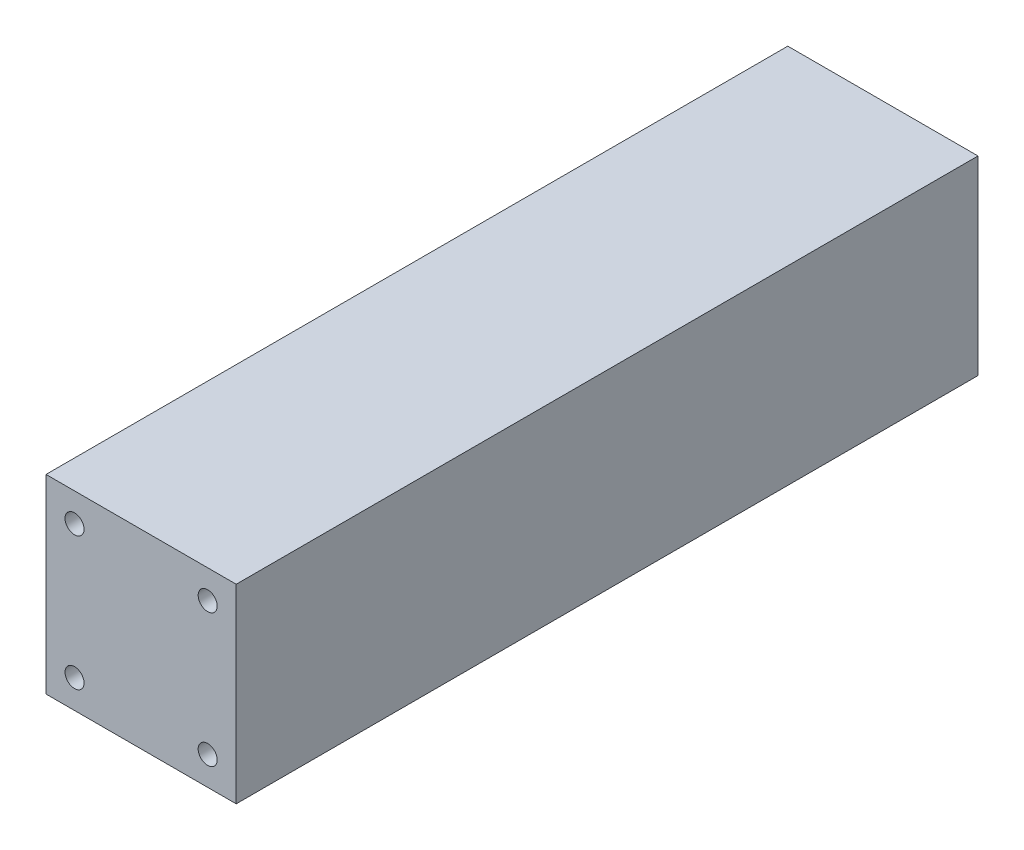
ISO-10303-21;
HEADER;
FILE_DESCRIPTION(('STEP AP214'),'2;1');
FILE_NAME('part.step','',(''),(''),'','','');
FILE_SCHEMA(('AUTOMOTIVE_DESIGN { 1 0 10303 214 1 1 1 1 }'));
ENDSEC;
DATA;
#1=APPLICATION_CONTEXT('core data for automotive mechanical design processes');
#2=APPLICATION_PROTOCOL_DEFINITION('international standard','automotive_design',2000,#1);
#3=PRODUCT_CONTEXT('',#1,'mechanical');
#4=PRODUCT('Part','Part','',(#3));
#5=PRODUCT_RELATED_PRODUCT_CATEGORY('part','',(#4));
#6=PRODUCT_DEFINITION_FORMATION('','',#4);
#7=PRODUCT_DEFINITION_CONTEXT('part definition',#1,'design');
#8=PRODUCT_DEFINITION('design','',#6,#7);
#9=PRODUCT_DEFINITION_SHAPE('','',#8);
#10=(LENGTH_UNIT() NAMED_UNIT(*) SI_UNIT(.MILLI.,.METRE.));
#11=(NAMED_UNIT(*) PLANE_ANGLE_UNIT() SI_UNIT($,.RADIAN.));
#12=(NAMED_UNIT(*) SI_UNIT($,.STERADIAN.) SOLID_ANGLE_UNIT());
#13=UNCERTAINTY_MEASURE_WITH_UNIT(LENGTH_MEASURE(1.E-05),#10,'distance_accuracy_value','');
#14=(GEOMETRIC_REPRESENTATION_CONTEXT(3) GLOBAL_UNCERTAINTY_ASSIGNED_CONTEXT((#13)) GLOBAL_UNIT_ASSIGNED_CONTEXT((#10,
#11,#12)) REPRESENTATION_CONTEXT('',''));
#15=CARTESIAN_POINT('',(0.,0.,0.));
#16=DIRECTION('',(0.,0.,1.));
#17=DIRECTION('',(1.,0.,0.));
#18=AXIS2_PLACEMENT_3D('',#15,#16,#17);
#19=CARTESIAN_POINT('',(-63.5,63.5,495.3));
#20=DIRECTION('',(1.,0.,0.));
#21=DIRECTION('',(0.,1.,0.));
#22=AXIS2_PLACEMENT_3D('',#19,#20,#21);
#23=PLANE('',#22);
#24=DIRECTION('',(0.,-1.,0.));
#25=VECTOR('',#24,1.);
#26=CARTESIAN_POINT('',(-63.5,63.5,0.));
#27=LINE('',#26,#25);
#28=CARTESIAN_POINT('',(-63.5,63.5,0.));
#29=VERTEX_POINT('',#28);
#30=CARTESIAN_POINT('',(-63.5,-63.5,0.));
#31=VERTEX_POINT('',#30);
#32=EDGE_CURVE('E211',#29,#31,#27,.T.);
#33=ORIENTED_EDGE('',*,*,#32,.T.);
#34=DIRECTION('',(0.,0.,-1.));
#35=VECTOR('',#34,1.);
#36=CARTESIAN_POINT('',(-63.5,-63.5,495.3));
#37=LINE('',#36,#35);
#38=CARTESIAN_POINT('',(-63.5,-63.5,495.3));
#39=VERTEX_POINT('',#38);
#40=EDGE_CURVE('E11',#39,#31,#37,.T.);
#41=ORIENTED_EDGE('',*,*,#40,.F.);
#42=DIRECTION('',(0.,-1.,0.));
#43=VECTOR('',#42,1.);
#44=CARTESIAN_POINT('',(-63.5,63.5,495.3));
#45=LINE('',#44,#43);
#46=CARTESIAN_POINT('',(-63.5,63.5,495.3));
#47=VERTEX_POINT('',#46);
#48=EDGE_CURVE('E212',#47,#39,#45,.T.);
#49=ORIENTED_EDGE('',*,*,#48,.F.);
#50=DIRECTION('',(0.,0.,-1.));
#51=VECTOR('',#50,1.);
#52=CARTESIAN_POINT('',(-63.5,63.5,495.3));
#53=LINE('',#52,#51);
#54=EDGE_CURVE('E218',#47,#29,#53,.T.);
#55=ORIENTED_EDGE('',*,*,#54,.T.);
#56=EDGE_LOOP('',(#33,#41,#49,#55));
#57=FACE_BOUND('',#56,.T.);
#58=ADVANCED_FACE('F38',(#57),#23,.F.);
#59=CARTESIAN_POINT('',(-63.5,-63.5,495.3));
#60=DIRECTION('',(0.,1.,0.));
#61=DIRECTION('',(-1.,0.,0.));
#62=AXIS2_PLACEMENT_3D('',#59,#60,#61);
#63=PLANE('',#62);
#64=DIRECTION('',(1.,0.,0.));
#65=VECTOR('',#64,1.);
#66=CARTESIAN_POINT('',(-63.5,-63.5,0.));
#67=LINE('',#66,#65);
#68=CARTESIAN_POINT('',(63.5,-63.5,0.));
#69=VERTEX_POINT('',#68);
#70=EDGE_CURVE('E221',#31,#69,#67,.T.);
#71=ORIENTED_EDGE('',*,*,#70,.T.);
#72=DIRECTION('',(0.,0.,-1.));
#73=VECTOR('',#72,1.);
#74=CARTESIAN_POINT('',(63.5,-63.5,495.3));
#75=LINE('',#74,#73);
#76=CARTESIAN_POINT('',(63.5,-63.5,495.3));
#77=VERTEX_POINT('',#76);
#78=EDGE_CURVE('E46',#77,#69,#75,.T.);
#79=ORIENTED_EDGE('',*,*,#78,.F.);
#80=DIRECTION('',(1.,0.,0.));
#81=VECTOR('',#80,1.);
#82=CARTESIAN_POINT('',(-63.5,-63.5,495.3));
#83=LINE('',#82,#81);
#84=EDGE_CURVE('E85',#39,#77,#83,.T.);
#85=ORIENTED_EDGE('',*,*,#84,.F.);
#86=ORIENTED_EDGE('',*,*,#40,.T.);
#87=EDGE_LOOP('',(#71,#79,#85,#86));
#88=FACE_BOUND('',#87,.T.);
#89=ADVANCED_FACE('F245',(#88),#63,.F.);
#90=CARTESIAN_POINT('',(63.5,63.5,495.3));
#91=DIRECTION('',(-1.,0.,0.));
#92=DIRECTION('',(0.,-1.,0.));
#93=AXIS2_PLACEMENT_3D('',#90,#91,#92);
#94=PLANE('',#93);
#95=DIRECTION('',(0.,1.,0.));
#96=VECTOR('',#95,1.);
#97=CARTESIAN_POINT('',(63.5,63.5,0.));
#98=LINE('',#97,#96);
#99=CARTESIAN_POINT('',(63.5,63.5,0.));
#100=VERTEX_POINT('',#99);
#101=EDGE_CURVE('E72',#69,#100,#98,.T.);
#102=ORIENTED_EDGE('',*,*,#101,.T.);
#103=DIRECTION('',(0.,0.,-1.));
#104=VECTOR('',#103,1.);
#105=CARTESIAN_POINT('',(63.5,63.5,495.3));
#106=LINE('',#105,#104);
#107=CARTESIAN_POINT('',(63.5,63.5,495.3));
#108=VERTEX_POINT('',#107);
#109=EDGE_CURVE('E226',#108,#100,#106,.T.);
#110=ORIENTED_EDGE('',*,*,#109,.F.);
#111=DIRECTION('',(0.,1.,0.));
#112=VECTOR('',#111,1.);
#113=CARTESIAN_POINT('',(63.5,63.5,495.3));
#114=LINE('',#113,#112);
#115=EDGE_CURVE('E215',#77,#108,#114,.T.);
#116=ORIENTED_EDGE('',*,*,#115,.F.);
#117=ORIENTED_EDGE('',*,*,#78,.T.);
#118=EDGE_LOOP('',(#102,#110,#116,#117));
#119=FACE_BOUND('',#118,.T.);
#120=ADVANCED_FACE('F228',(#119),#94,.F.);
#121=CARTESIAN_POINT('',(-63.5,63.5,495.3));
#122=DIRECTION('',(0.,-1.,0.));
#123=DIRECTION('',(0.,0.,-1.));
#124=AXIS2_PLACEMENT_3D('',#121,#122,#123);
#125=PLANE('',#124);
#126=DIRECTION('',(-1.,0.,0.));
#127=VECTOR('',#126,1.);
#128=CARTESIAN_POINT('',(-63.5,63.5,0.));
#129=LINE('',#128,#127);
#130=EDGE_CURVE('E78',#100,#29,#129,.T.);
#131=ORIENTED_EDGE('',*,*,#130,.T.);
#132=ORIENTED_EDGE('',*,*,#54,.F.);
#133=DIRECTION('',(-1.,0.,0.));
#134=VECTOR('',#133,1.);
#135=CARTESIAN_POINT('',(-63.5,63.5,495.3));
#136=LINE('',#135,#134);
#137=EDGE_CURVE('E54',#108,#47,#136,.T.);
#138=ORIENTED_EDGE('',*,*,#137,.F.);
#139=ORIENTED_EDGE('',*,*,#109,.T.);
#140=EDGE_LOOP('',(#131,#132,#138,#139));
#141=FACE_BOUND('',#140,.T.);
#142=ADVANCED_FACE('F235',(#141),#125,.F.);
#143=CARTESIAN_POINT('',(-63.5,-63.5,495.3));
#144=DIRECTION('',(0.,0.,1.));
#145=DIRECTION('',(1.,0.,0.));
#146=AXIS2_PLACEMENT_3D('',#143,#144,#145);
#147=PLANE('',#146);
#148=CARTESIAN_POINT('',(44.45,44.45,495.3));
#149=DIRECTION('',(0.,0.,1.));
#150=DIRECTION('',(1.,0.,0.));
#151=AXIS2_PLACEMENT_3D('',#148,#149,#150);
#152=CIRCLE('',#151,6.34999999999999);
#153=CARTESIAN_POINT('',(50.8,44.45,495.3));
#154=VERTEX_POINT('',#153);
#155=EDGE_CURVE('E163',#154,#154,#152,.T.);
#156=ORIENTED_EDGE('',*,*,#155,.F.);
#157=EDGE_LOOP('',(#156));
#158=FACE_BOUND('',#157,.T.);
#159=CARTESIAN_POINT('',(44.45,-44.45,495.3));
#160=DIRECTION('',(0.,0.,1.));
#161=DIRECTION('',(1.,0.,0.));
#162=AXIS2_PLACEMENT_3D('',#159,#160,#161);
#163=CIRCLE('',#162,6.34999999999999);
#164=CARTESIAN_POINT('',(50.8,-44.45,495.3));
#165=VERTEX_POINT('',#164);
#166=EDGE_CURVE('E175',#165,#165,#163,.T.);
#167=ORIENTED_EDGE('',*,*,#166,.F.);
#168=EDGE_LOOP('',(#167));
#169=FACE_BOUND('',#168,.T.);
#170=CARTESIAN_POINT('',(-44.45,-44.45,495.3));
#171=DIRECTION('',(0.,0.,1.));
#172=DIRECTION('',(1.,0.,0.));
#173=AXIS2_PLACEMENT_3D('',#170,#171,#172);
#174=CIRCLE('',#173,6.34999999999999);
#175=CARTESIAN_POINT('',(-38.1,-44.45,495.3));
#176=VERTEX_POINT('',#175);
#177=EDGE_CURVE('E187',#176,#176,#174,.T.);
#178=ORIENTED_EDGE('',*,*,#177,.F.);
#179=EDGE_LOOP('',(#178));
#180=FACE_BOUND('',#179,.T.);
#181=CARTESIAN_POINT('',(-44.45,44.45,495.3));
#182=DIRECTION('',(0.,0.,1.));
#183=DIRECTION('',(1.,0.,0.));
#184=AXIS2_PLACEMENT_3D('',#181,#182,#183);
#185=CIRCLE('',#184,6.34999999999999);
#186=CARTESIAN_POINT('',(-38.1,44.45,495.3));
#187=VERTEX_POINT('',#186);
#188=EDGE_CURVE('E199',#187,#187,#185,.T.);
#189=ORIENTED_EDGE('',*,*,#188,.F.);
#190=EDGE_LOOP('',(#189));
#191=FACE_BOUND('',#190,.T.);
#192=ORIENTED_EDGE('',*,*,#48,.T.);
#193=ORIENTED_EDGE('',*,*,#84,.T.);
#194=ORIENTED_EDGE('',*,*,#115,.T.);
#195=ORIENTED_EDGE('',*,*,#137,.T.);
#196=EDGE_LOOP('',(#192,#193,#194,#195));
#197=FACE_BOUND('',#196,.T.);
#198=ADVANCED_FACE('F237',(#158,#169,#180,#191,#197),#147,.T.);
#199=CARTESIAN_POINT('',(-63.5,-63.5,0.));
#200=DIRECTION('',(0.,0.,1.));
#201=DIRECTION('',(1.,0.,0.));
#202=AXIS2_PLACEMENT_3D('',#199,#200,#201);
#203=PLANE('',#202);
#204=CARTESIAN_POINT('',(44.45,44.45,0.));
#205=DIRECTION('',(0.,0.,-1.));
#206=DIRECTION('',(-1.,0.,0.));
#207=AXIS2_PLACEMENT_3D('',#204,#205,#206);
#208=CIRCLE('',#207,6.34999999999999);
#209=CARTESIAN_POINT('',(38.1,44.45,0.));
#210=VERTEX_POINT('',#209);
#211=EDGE_CURVE('E600',#210,#210,#208,.T.);
#212=ORIENTED_EDGE('',*,*,#211,.F.);
#213=EDGE_LOOP('',(#212));
#214=FACE_BOUND('',#213,.T.);
#215=CARTESIAN_POINT('',(-44.45,44.45,0.));
#216=DIRECTION('',(0.,0.,-1.));
#217=DIRECTION('',(-1.,0.,0.));
#218=AXIS2_PLACEMENT_3D('',#215,#216,#217);
#219=CIRCLE('',#218,6.34999999999999);
#220=CARTESIAN_POINT('',(-50.8,44.45,0.));
#221=VERTEX_POINT('',#220);
#222=EDGE_CURVE('E120',#221,#221,#219,.T.);
#223=ORIENTED_EDGE('',*,*,#222,.F.);
#224=EDGE_LOOP('',(#223));
#225=FACE_BOUND('',#224,.T.);
#226=CARTESIAN_POINT('',(44.45,-44.45,0.));
#227=DIRECTION('',(0.,0.,-1.));
#228=DIRECTION('',(-1.,0.,0.));
#229=AXIS2_PLACEMENT_3D('',#226,#227,#228);
#230=CIRCLE('',#229,6.34999999999999);
#231=CARTESIAN_POINT('',(38.1,-44.45,0.));
#232=VERTEX_POINT('',#231);
#233=EDGE_CURVE('E139',#232,#232,#230,.T.);
#234=ORIENTED_EDGE('',*,*,#233,.F.);
#235=EDGE_LOOP('',(#234));
#236=FACE_BOUND('',#235,.T.);
#237=CARTESIAN_POINT('',(-44.45,-44.45,0.));
#238=DIRECTION('',(0.,0.,-1.));
#239=DIRECTION('',(-1.,0.,0.));
#240=AXIS2_PLACEMENT_3D('',#237,#238,#239);
#241=CIRCLE('',#240,6.34999999999999);
#242=CARTESIAN_POINT('',(-50.8,-44.45,0.));
#243=VERTEX_POINT('',#242);
#244=EDGE_CURVE('E151',#243,#243,#241,.T.);
#245=ORIENTED_EDGE('',*,*,#244,.F.);
#246=EDGE_LOOP('',(#245));
#247=FACE_BOUND('',#246,.T.);
#248=ORIENTED_EDGE('',*,*,#32,.F.);
#249=ORIENTED_EDGE('',*,*,#130,.F.);
#250=ORIENTED_EDGE('',*,*,#101,.F.);
#251=ORIENTED_EDGE('',*,*,#70,.F.);
#252=EDGE_LOOP('',(#248,#249,#250,#251));
#253=FACE_BOUND('',#252,.T.);
#254=ADVANCED_FACE('F231',(#214,#225,#236,#247,#253),#203,.F.);
#255=CARTESIAN_POINT('',(-44.45,44.45,464.0326));
#256=DIRECTION('',(0.,0.,1.));
#257=DIRECTION('',(1.,0.,0.));
#258=AXIS2_PLACEMENT_3D('',#255,#256,#257);
#259=CONICAL_SURFACE('',#258,5.35813,1.02974425867665);
#260=CARTESIAN_POINT('',(-44.45,44.45,460.81311069137));
#261=VERTEX_POINT('',#260);
#262=VERTEX_LOOP('',#261);
#263=FACE_BOUND('',#262,.T.);
#264=CARTESIAN_POINT('',(-44.45,44.45,464.0326));
#265=DIRECTION('',(0.,0.,1.));
#266=DIRECTION('',(1.,0.,0.));
#267=AXIS2_PLACEMENT_3D('',#264,#265,#266);
#268=CIRCLE('',#267,5.35813);
#269=CARTESIAN_POINT('',(-39.09187,44.45,464.0326));
#270=VERTEX_POINT('',#269);
#271=EDGE_CURVE('E208',#270,#270,#268,.T.);
#272=ORIENTED_EDGE('',*,*,#271,.T.);
#273=EDGE_LOOP('',(#272));
#274=FACE_BOUND('',#273,.T.);
#275=ADVANCED_FACE('F279',(#263,#274),#259,.F.);
#276=CARTESIAN_POINT('',(-44.45,44.45,495.3));
#277=DIRECTION('',(0.,0.,1.));
#278=DIRECTION('',(1.,0.,0.));
#279=AXIS2_PLACEMENT_3D('',#276,#277,#278);
#280=CYLINDRICAL_SURFACE('',#279,5.35813);
#281=ORIENTED_EDGE('',*,*,#271,.F.);
#282=EDGE_LOOP('',(#281));
#283=FACE_BOUND('',#282,.T.);
#284=CARTESIAN_POINT('',(-44.45,44.45,469.9));
#285=DIRECTION('',(0.,0.,1.));
#286=DIRECTION('',(1.,0.,0.));
#287=AXIS2_PLACEMENT_3D('',#284,#285,#286);
#288=CIRCLE('',#287,5.35813);
#289=CARTESIAN_POINT('',(-39.09187,44.45,469.9));
#290=VERTEX_POINT('',#289);
#291=EDGE_CURVE('E205',#290,#290,#288,.T.);
#292=ORIENTED_EDGE('',*,*,#291,.T.);
#293=EDGE_LOOP('',(#292));
#294=FACE_BOUND('',#293,.T.);
#295=ADVANCED_FACE('F288',(#283,#294),#280,.F.);
#296=CARTESIAN_POINT('',(-39.09187,44.45,469.9));
#297=DIRECTION('',(0.,0.,-1.));
#298=DIRECTION('',(-1.,0.,0.));
#299=AXIS2_PLACEMENT_3D('',#296,#297,#298);
#300=PLANE('',#299);
#301=ORIENTED_EDGE('',*,*,#291,.F.);
#302=EDGE_LOOP('',(#301));
#303=FACE_BOUND('',#302,.T.);
#304=CARTESIAN_POINT('',(-44.45,44.45,469.9));
#305=DIRECTION('',(0.,0.,1.));
#306=DIRECTION('',(1.,0.,0.));
#307=AXIS2_PLACEMENT_3D('',#304,#305,#306);
#308=CIRCLE('',#307,6.34999999999999);
#309=CARTESIAN_POINT('',(-38.1,44.45,469.9));
#310=VERTEX_POINT('',#309);
#311=EDGE_CURVE('E202',#310,#310,#308,.T.);
#312=ORIENTED_EDGE('',*,*,#311,.T.);
#313=EDGE_LOOP('',(#312));
#314=FACE_BOUND('',#313,.T.);
#315=ADVANCED_FACE('F298',(#303,#314),#300,.F.);
#316=CARTESIAN_POINT('',(-44.45,44.45,495.3));
#317=DIRECTION('',(0.,0.,1.));
#318=DIRECTION('',(1.,0.,0.));
#319=AXIS2_PLACEMENT_3D('',#316,#317,#318);
#320=CYLINDRICAL_SURFACE('',#319,6.34999999999999);
#321=ORIENTED_EDGE('',*,*,#311,.F.);
#322=EDGE_LOOP('',(#321));
#323=FACE_BOUND('',#322,.T.);
#324=ORIENTED_EDGE('',*,*,#188,.T.);
#325=EDGE_LOOP('',(#324));
#326=FACE_BOUND('',#325,.T.);
#327=ADVANCED_FACE('F308',(#323,#326),#320,.F.);
#328=CARTESIAN_POINT('',(-44.45,-44.45,464.0326));
#329=DIRECTION('',(0.,0.,1.));
#330=DIRECTION('',(1.,0.,0.));
#331=AXIS2_PLACEMENT_3D('',#328,#329,#330);
#332=CONICAL_SURFACE('',#331,5.35813,1.02974425867665);
#333=CARTESIAN_POINT('',(-44.45,-44.45,460.81311069137));
#334=VERTEX_POINT('',#333);
#335=VERTEX_LOOP('',#334);
#336=FACE_BOUND('',#335,.T.);
#337=CARTESIAN_POINT('',(-44.45,-44.45,464.0326));
#338=DIRECTION('',(0.,0.,1.));
#339=DIRECTION('',(1.,0.,0.));
#340=AXIS2_PLACEMENT_3D('',#337,#338,#339);
#341=CIRCLE('',#340,5.35813);
#342=CARTESIAN_POINT('',(-39.09187,-44.45,464.0326));
#343=VERTEX_POINT('',#342);
#344=EDGE_CURVE('E196',#343,#343,#341,.T.);
#345=ORIENTED_EDGE('',*,*,#344,.T.);
#346=EDGE_LOOP('',(#345));
#347=FACE_BOUND('',#346,.T.);
#348=ADVANCED_FACE('F318',(#336,#347),#332,.F.);
#349=CARTESIAN_POINT('',(-44.45,-44.45,495.3));
#350=DIRECTION('',(0.,0.,1.));
#351=DIRECTION('',(1.,0.,0.));
#352=AXIS2_PLACEMENT_3D('',#349,#350,#351);
#353=CYLINDRICAL_SURFACE('',#352,5.35813);
#354=ORIENTED_EDGE('',*,*,#344,.F.);
#355=EDGE_LOOP('',(#354));
#356=FACE_BOUND('',#355,.T.);
#357=CARTESIAN_POINT('',(-44.45,-44.45,469.9));
#358=DIRECTION('',(0.,0.,1.));
#359=DIRECTION('',(1.,0.,0.));
#360=AXIS2_PLACEMENT_3D('',#357,#358,#359);
#361=CIRCLE('',#360,5.35813);
#362=CARTESIAN_POINT('',(-39.09187,-44.45,469.9));
#363=VERTEX_POINT('',#362);
#364=EDGE_CURVE('E193',#363,#363,#361,.T.);
#365=ORIENTED_EDGE('',*,*,#364,.T.);
#366=EDGE_LOOP('',(#365));
#367=FACE_BOUND('',#366,.T.);
#368=ADVANCED_FACE('F328',(#356,#367),#353,.F.);
#369=CARTESIAN_POINT('',(-39.09187,-44.45,469.9));
#370=DIRECTION('',(0.,0.,-1.));
#371=DIRECTION('',(-1.,0.,0.));
#372=AXIS2_PLACEMENT_3D('',#369,#370,#371);
#373=PLANE('',#372);
#374=ORIENTED_EDGE('',*,*,#364,.F.);
#375=EDGE_LOOP('',(#374));
#376=FACE_BOUND('',#375,.T.);
#377=CARTESIAN_POINT('',(-44.45,-44.45,469.9));
#378=DIRECTION('',(0.,0.,1.));
#379=DIRECTION('',(1.,0.,0.));
#380=AXIS2_PLACEMENT_3D('',#377,#378,#379);
#381=CIRCLE('',#380,6.34999999999999);
#382=CARTESIAN_POINT('',(-38.1,-44.45,469.9));
#383=VERTEX_POINT('',#382);
#384=EDGE_CURVE('E190',#383,#383,#381,.T.);
#385=ORIENTED_EDGE('',*,*,#384,.T.);
#386=EDGE_LOOP('',(#385));
#387=FACE_BOUND('',#386,.T.);
#388=ADVANCED_FACE('F338',(#376,#387),#373,.F.);
#389=CARTESIAN_POINT('',(-44.45,-44.45,495.3));
#390=DIRECTION('',(0.,0.,1.));
#391=DIRECTION('',(1.,0.,0.));
#392=AXIS2_PLACEMENT_3D('',#389,#390,#391);
#393=CYLINDRICAL_SURFACE('',#392,6.34999999999999);
#394=ORIENTED_EDGE('',*,*,#384,.F.);
#395=EDGE_LOOP('',(#394));
#396=FACE_BOUND('',#395,.T.);
#397=ORIENTED_EDGE('',*,*,#177,.T.);
#398=EDGE_LOOP('',(#397));
#399=FACE_BOUND('',#398,.T.);
#400=ADVANCED_FACE('F348',(#396,#399),#393,.F.);
#401=CARTESIAN_POINT('',(44.45,-44.45,464.0326));
#402=DIRECTION('',(0.,0.,1.));
#403=DIRECTION('',(1.,0.,0.));
#404=AXIS2_PLACEMENT_3D('',#401,#402,#403);
#405=CONICAL_SURFACE('',#404,5.35813,1.02974425867665);
#406=CARTESIAN_POINT('',(44.45,-44.45,460.81311069137));
#407=VERTEX_POINT('',#406);
#408=VERTEX_LOOP('',#407);
#409=FACE_BOUND('',#408,.T.);
#410=CARTESIAN_POINT('',(44.45,-44.45,464.0326));
#411=DIRECTION('',(0.,0.,1.));
#412=DIRECTION('',(1.,0.,0.));
#413=AXIS2_PLACEMENT_3D('',#410,#411,#412);
#414=CIRCLE('',#413,5.35813);
#415=CARTESIAN_POINT('',(49.80813,-44.45,464.0326));
#416=VERTEX_POINT('',#415);
#417=EDGE_CURVE('E184',#416,#416,#414,.T.);
#418=ORIENTED_EDGE('',*,*,#417,.T.);
#419=EDGE_LOOP('',(#418));
#420=FACE_BOUND('',#419,.T.);
#421=ADVANCED_FACE('F358',(#409,#420),#405,.F.);
#422=CARTESIAN_POINT('',(44.45,-44.45,495.3));
#423=DIRECTION('',(0.,0.,1.));
#424=DIRECTION('',(1.,0.,0.));
#425=AXIS2_PLACEMENT_3D('',#422,#423,#424);
#426=CYLINDRICAL_SURFACE('',#425,5.35813);
#427=ORIENTED_EDGE('',*,*,#417,.F.);
#428=EDGE_LOOP('',(#427));
#429=FACE_BOUND('',#428,.T.);
#430=CARTESIAN_POINT('',(44.45,-44.45,469.9));
#431=DIRECTION('',(0.,0.,1.));
#432=DIRECTION('',(1.,0.,0.));
#433=AXIS2_PLACEMENT_3D('',#430,#431,#432);
#434=CIRCLE('',#433,5.35813);
#435=CARTESIAN_POINT('',(49.80813,-44.45,469.9));
#436=VERTEX_POINT('',#435);
#437=EDGE_CURVE('E181',#436,#436,#434,.T.);
#438=ORIENTED_EDGE('',*,*,#437,.T.);
#439=EDGE_LOOP('',(#438));
#440=FACE_BOUND('',#439,.T.);
#441=ADVANCED_FACE('F368',(#429,#440),#426,.F.);
#442=CARTESIAN_POINT('',(49.80813,-44.45,469.9));
#443=DIRECTION('',(0.,0.,-1.));
#444=DIRECTION('',(-1.,0.,0.));
#445=AXIS2_PLACEMENT_3D('',#442,#443,#444);
#446=PLANE('',#445);
#447=ORIENTED_EDGE('',*,*,#437,.F.);
#448=EDGE_LOOP('',(#447));
#449=FACE_BOUND('',#448,.T.);
#450=CARTESIAN_POINT('',(44.45,-44.45,469.9));
#451=DIRECTION('',(0.,0.,1.));
#452=DIRECTION('',(1.,0.,0.));
#453=AXIS2_PLACEMENT_3D('',#450,#451,#452);
#454=CIRCLE('',#453,6.34999999999999);
#455=CARTESIAN_POINT('',(50.8,-44.45,469.9));
#456=VERTEX_POINT('',#455);
#457=EDGE_CURVE('E178',#456,#456,#454,.T.);
#458=ORIENTED_EDGE('',*,*,#457,.T.);
#459=EDGE_LOOP('',(#458));
#460=FACE_BOUND('',#459,.T.);
#461=ADVANCED_FACE('F378',(#449,#460),#446,.F.);
#462=CARTESIAN_POINT('',(44.45,-44.45,495.3));
#463=DIRECTION('',(0.,0.,1.));
#464=DIRECTION('',(1.,0.,0.));
#465=AXIS2_PLACEMENT_3D('',#462,#463,#464);
#466=CYLINDRICAL_SURFACE('',#465,6.34999999999999);
#467=ORIENTED_EDGE('',*,*,#457,.F.);
#468=EDGE_LOOP('',(#467));
#469=FACE_BOUND('',#468,.T.);
#470=ORIENTED_EDGE('',*,*,#166,.T.);
#471=EDGE_LOOP('',(#470));
#472=FACE_BOUND('',#471,.T.);
#473=ADVANCED_FACE('F388',(#469,#472),#466,.F.);
#474=CARTESIAN_POINT('',(44.45,44.45,464.0326));
#475=DIRECTION('',(0.,0.,1.));
#476=DIRECTION('',(1.,0.,0.));
#477=AXIS2_PLACEMENT_3D('',#474,#475,#476);
#478=CONICAL_SURFACE('',#477,5.35813,1.02974425867665);
#479=CARTESIAN_POINT('',(44.45,44.45,460.81311069137));
#480=VERTEX_POINT('',#479);
#481=VERTEX_LOOP('',#480);
#482=FACE_BOUND('',#481,.T.);
#483=CARTESIAN_POINT('',(44.45,44.45,464.0326));
#484=DIRECTION('',(0.,0.,1.));
#485=DIRECTION('',(1.,0.,0.));
#486=AXIS2_PLACEMENT_3D('',#483,#484,#485);
#487=CIRCLE('',#486,5.35813);
#488=CARTESIAN_POINT('',(49.80813,44.45,464.0326));
#489=VERTEX_POINT('',#488);
#490=EDGE_CURVE('E172',#489,#489,#487,.T.);
#491=ORIENTED_EDGE('',*,*,#490,.T.);
#492=EDGE_LOOP('',(#491));
#493=FACE_BOUND('',#492,.T.);
#494=ADVANCED_FACE('F398',(#482,#493),#478,.F.);
#495=CARTESIAN_POINT('',(44.45,44.45,495.3));
#496=DIRECTION('',(0.,0.,1.));
#497=DIRECTION('',(1.,0.,0.));
#498=AXIS2_PLACEMENT_3D('',#495,#496,#497);
#499=CYLINDRICAL_SURFACE('',#498,5.35813);
#500=ORIENTED_EDGE('',*,*,#490,.F.);
#501=EDGE_LOOP('',(#500));
#502=FACE_BOUND('',#501,.T.);
#503=CARTESIAN_POINT('',(44.45,44.45,469.9));
#504=DIRECTION('',(0.,0.,1.));
#505=DIRECTION('',(1.,0.,0.));
#506=AXIS2_PLACEMENT_3D('',#503,#504,#505);
#507=CIRCLE('',#506,5.35813);
#508=CARTESIAN_POINT('',(49.80813,44.45,469.9));
#509=VERTEX_POINT('',#508);
#510=EDGE_CURVE('E169',#509,#509,#507,.T.);
#511=ORIENTED_EDGE('',*,*,#510,.T.);
#512=EDGE_LOOP('',(#511));
#513=FACE_BOUND('',#512,.T.);
#514=ADVANCED_FACE('F408',(#502,#513),#499,.F.);
#515=CARTESIAN_POINT('',(49.80813,44.45,469.9));
#516=DIRECTION('',(0.,0.,-1.));
#517=DIRECTION('',(-1.,0.,0.));
#518=AXIS2_PLACEMENT_3D('',#515,#516,#517);
#519=PLANE('',#518);
#520=ORIENTED_EDGE('',*,*,#510,.F.);
#521=EDGE_LOOP('',(#520));
#522=FACE_BOUND('',#521,.T.);
#523=CARTESIAN_POINT('',(44.45,44.45,469.9));
#524=DIRECTION('',(0.,0.,1.));
#525=DIRECTION('',(1.,0.,0.));
#526=AXIS2_PLACEMENT_3D('',#523,#524,#525);
#527=CIRCLE('',#526,6.34999999999999);
#528=CARTESIAN_POINT('',(50.8,44.45,469.9));
#529=VERTEX_POINT('',#528);
#530=EDGE_CURVE('E166',#529,#529,#527,.T.);
#531=ORIENTED_EDGE('',*,*,#530,.T.);
#532=EDGE_LOOP('',(#531));
#533=FACE_BOUND('',#532,.T.);
#534=ADVANCED_FACE('F418',(#522,#533),#519,.F.);
#535=CARTESIAN_POINT('',(44.45,44.45,495.3));
#536=DIRECTION('',(0.,0.,1.));
#537=DIRECTION('',(1.,0.,0.));
#538=AXIS2_PLACEMENT_3D('',#535,#536,#537);
#539=CYLINDRICAL_SURFACE('',#538,6.34999999999999);
#540=ORIENTED_EDGE('',*,*,#530,.F.);
#541=EDGE_LOOP('',(#540));
#542=FACE_BOUND('',#541,.T.);
#543=ORIENTED_EDGE('',*,*,#155,.T.);
#544=EDGE_LOOP('',(#543));
#545=FACE_BOUND('',#544,.T.);
#546=ADVANCED_FACE('F428',(#542,#545),#539,.F.);
#547=CARTESIAN_POINT('',(-44.45,-44.45,31.2674));
#548=DIRECTION('',(0.,0.,-1.));
#549=DIRECTION('',(-1.,0.,0.));
#550=AXIS2_PLACEMENT_3D('',#547,#548,#549);
#551=CONICAL_SURFACE('',#550,5.35813,1.02974425867665);
#552=CARTESIAN_POINT('',(-44.45,-44.45,34.4868893086301));
#553=VERTEX_POINT('',#552);
#554=VERTEX_LOOP('',#553);
#555=FACE_BOUND('',#554,.T.);
#556=CARTESIAN_POINT('',(-44.45,-44.45,31.2674));
#557=DIRECTION('',(0.,0.,-1.));
#558=DIRECTION('',(-1.,0.,0.));
#559=AXIS2_PLACEMENT_3D('',#556,#557,#558);
#560=CIRCLE('',#559,5.35813);
#561=CARTESIAN_POINT('',(-49.80813,-44.45,31.2674));
#562=VERTEX_POINT('',#561);
#563=EDGE_CURVE('E160',#562,#562,#560,.T.);
#564=ORIENTED_EDGE('',*,*,#563,.T.);
#565=EDGE_LOOP('',(#564));
#566=FACE_BOUND('',#565,.T.);
#567=ADVANCED_FACE('F438',(#555,#566),#551,.F.);
#568=CARTESIAN_POINT('',(-44.45,-44.45,0.));
#569=DIRECTION('',(0.,0.,-1.));
#570=DIRECTION('',(-1.,0.,0.));
#571=AXIS2_PLACEMENT_3D('',#568,#569,#570);
#572=CYLINDRICAL_SURFACE('',#571,5.35812999999999);
#573=ORIENTED_EDGE('',*,*,#563,.F.);
#574=EDGE_LOOP('',(#573));
#575=FACE_BOUND('',#574,.T.);
#576=CARTESIAN_POINT('',(-44.45,-44.45,25.4));
#577=DIRECTION('',(0.,0.,-1.));
#578=DIRECTION('',(-1.,0.,0.));
#579=AXIS2_PLACEMENT_3D('',#576,#577,#578);
#580=CIRCLE('',#579,5.35812999999999);
#581=CARTESIAN_POINT('',(-49.80813,-44.45,25.4));
#582=VERTEX_POINT('',#581);
#583=EDGE_CURVE('E157',#582,#582,#580,.T.);
#584=ORIENTED_EDGE('',*,*,#583,.T.);
#585=EDGE_LOOP('',(#584));
#586=FACE_BOUND('',#585,.T.);
#587=ADVANCED_FACE('F448',(#575,#586),#572,.F.);
#588=CARTESIAN_POINT('',(-39.09187,-44.45,25.4));
#589=DIRECTION('',(0.,0.,1.));
#590=DIRECTION('',(1.,0.,0.));
#591=AXIS2_PLACEMENT_3D('',#588,#589,#590);
#592=PLANE('',#591);
#593=ORIENTED_EDGE('',*,*,#583,.F.);
#594=EDGE_LOOP('',(#593));
#595=FACE_BOUND('',#594,.T.);
#596=CARTESIAN_POINT('',(-44.45,-44.45,25.4));
#597=DIRECTION('',(0.,0.,-1.));
#598=DIRECTION('',(-1.,0.,0.));
#599=AXIS2_PLACEMENT_3D('',#596,#597,#598);
#600=CIRCLE('',#599,6.34999999999999);
#601=CARTESIAN_POINT('',(-50.8,-44.45,25.4));
#602=VERTEX_POINT('',#601);
#603=EDGE_CURVE('E154',#602,#602,#600,.T.);
#604=ORIENTED_EDGE('',*,*,#603,.T.);
#605=EDGE_LOOP('',(#604));
#606=FACE_BOUND('',#605,.T.);
#607=ADVANCED_FACE('F458',(#595,#606),#592,.F.);
#608=CARTESIAN_POINT('',(-44.45,-44.45,0.));
#609=DIRECTION('',(0.,0.,-1.));
#610=DIRECTION('',(-1.,0.,0.));
#611=AXIS2_PLACEMENT_3D('',#608,#609,#610);
#612=CYLINDRICAL_SURFACE('',#611,6.34999999999999);
#613=ORIENTED_EDGE('',*,*,#603,.F.);
#614=EDGE_LOOP('',(#613));
#615=FACE_BOUND('',#614,.T.);
#616=ORIENTED_EDGE('',*,*,#244,.T.);
#617=EDGE_LOOP('',(#616));
#618=FACE_BOUND('',#617,.T.);
#619=ADVANCED_FACE('F468',(#615,#618),#612,.F.);
#620=CARTESIAN_POINT('',(44.45,-44.45,31.2674));
#621=DIRECTION('',(0.,0.,-1.));
#622=DIRECTION('',(-1.,0.,0.));
#623=AXIS2_PLACEMENT_3D('',#620,#621,#622);
#624=CONICAL_SURFACE('',#623,5.35812999999999,1.02974425867665);
#625=CARTESIAN_POINT('',(44.45,-44.45,34.4868893086301));
#626=VERTEX_POINT('',#625);
#627=VERTEX_LOOP('',#626);
#628=FACE_BOUND('',#627,.T.);
#629=CARTESIAN_POINT('',(44.45,-44.45,31.2674));
#630=DIRECTION('',(0.,0.,-1.));
#631=DIRECTION('',(-1.,0.,0.));
#632=AXIS2_PLACEMENT_3D('',#629,#630,#631);
#633=CIRCLE('',#632,5.35812999999999);
#634=CARTESIAN_POINT('',(39.09187,-44.45,31.2674));
#635=VERTEX_POINT('',#634);
#636=EDGE_CURVE('E148',#635,#635,#633,.T.);
#637=ORIENTED_EDGE('',*,*,#636,.T.);
#638=EDGE_LOOP('',(#637));
#639=FACE_BOUND('',#638,.T.);
#640=ADVANCED_FACE('F478',(#628,#639),#624,.F.);
#641=CARTESIAN_POINT('',(44.45,-44.45,0.));
#642=DIRECTION('',(0.,0.,-1.));
#643=DIRECTION('',(-1.,0.,0.));
#644=AXIS2_PLACEMENT_3D('',#641,#642,#643);
#645=CYLINDRICAL_SURFACE('',#644,5.35812999999999);
#646=ORIENTED_EDGE('',*,*,#636,.F.);
#647=EDGE_LOOP('',(#646));
#648=FACE_BOUND('',#647,.T.);
#649=CARTESIAN_POINT('',(44.45,-44.45,25.4));
#650=DIRECTION('',(0.,0.,-1.));
#651=DIRECTION('',(-1.,0.,0.));
#652=AXIS2_PLACEMENT_3D('',#649,#650,#651);
#653=CIRCLE('',#652,5.35812999999999);
#654=CARTESIAN_POINT('',(39.09187,-44.45,25.4));
#655=VERTEX_POINT('',#654);
#656=EDGE_CURVE('E145',#655,#655,#653,.T.);
#657=ORIENTED_EDGE('',*,*,#656,.T.);
#658=EDGE_LOOP('',(#657));
#659=FACE_BOUND('',#658,.T.);
#660=ADVANCED_FACE('F488',(#648,#659),#645,.F.);
#661=CARTESIAN_POINT('',(49.80813,-44.45,25.4));
#662=DIRECTION('',(0.,0.,1.));
#663=DIRECTION('',(1.,0.,0.));
#664=AXIS2_PLACEMENT_3D('',#661,#662,#663);
#665=PLANE('',#664);
#666=ORIENTED_EDGE('',*,*,#656,.F.);
#667=EDGE_LOOP('',(#666));
#668=FACE_BOUND('',#667,.T.);
#669=CARTESIAN_POINT('',(44.45,-44.45,25.4));
#670=DIRECTION('',(0.,0.,-1.));
#671=DIRECTION('',(-1.,0.,0.));
#672=AXIS2_PLACEMENT_3D('',#669,#670,#671);
#673=CIRCLE('',#672,6.34999999999999);
#674=CARTESIAN_POINT('',(38.1,-44.45,25.4));
#675=VERTEX_POINT('',#674);
#676=EDGE_CURVE('E142',#675,#675,#673,.T.);
#677=ORIENTED_EDGE('',*,*,#676,.T.);
#678=EDGE_LOOP('',(#677));
#679=FACE_BOUND('',#678,.T.);
#680=ADVANCED_FACE('F498',(#668,#679),#665,.F.);
#681=CARTESIAN_POINT('',(44.45,-44.45,0.));
#682=DIRECTION('',(0.,0.,-1.));
#683=DIRECTION('',(-1.,0.,0.));
#684=AXIS2_PLACEMENT_3D('',#681,#682,#683);
#685=CYLINDRICAL_SURFACE('',#684,6.34999999999999);
#686=ORIENTED_EDGE('',*,*,#676,.F.);
#687=EDGE_LOOP('',(#686));
#688=FACE_BOUND('',#687,.T.);
#689=ORIENTED_EDGE('',*,*,#233,.T.);
#690=EDGE_LOOP('',(#689));
#691=FACE_BOUND('',#690,.T.);
#692=ADVANCED_FACE('F508',(#688,#691),#685,.F.);
#693=CARTESIAN_POINT('',(-44.45,44.45,31.2674));
#694=DIRECTION('',(0.,0.,-1.));
#695=DIRECTION('',(-1.,0.,0.));
#696=AXIS2_PLACEMENT_3D('',#693,#694,#695);
#697=CONICAL_SURFACE('',#696,5.35812999999999,1.02974425867665);
#698=CARTESIAN_POINT('',(-44.45,44.45,34.4868893086301));
#699=VERTEX_POINT('',#698);
#700=VERTEX_LOOP('',#699);
#701=FACE_BOUND('',#700,.T.);
#702=CARTESIAN_POINT('',(-44.45,44.45,31.2674));
#703=DIRECTION('',(0.,0.,-1.));
#704=DIRECTION('',(-1.,0.,0.));
#705=AXIS2_PLACEMENT_3D('',#702,#703,#704);
#706=CIRCLE('',#705,5.35812999999999);
#707=CARTESIAN_POINT('',(-49.80813,44.45,31.2674));
#708=VERTEX_POINT('',#707);
#709=EDGE_CURVE('E136',#708,#708,#706,.T.);
#710=ORIENTED_EDGE('',*,*,#709,.T.);
#711=EDGE_LOOP('',(#710));
#712=FACE_BOUND('',#711,.T.);
#713=ADVANCED_FACE('F518',(#701,#712),#697,.F.);
#714=CARTESIAN_POINT('',(-44.45,44.45,0.));
#715=DIRECTION('',(0.,0.,-1.));
#716=DIRECTION('',(-1.,0.,0.));
#717=AXIS2_PLACEMENT_3D('',#714,#715,#716);
#718=CYLINDRICAL_SURFACE('',#717,5.35812999999999);
#719=ORIENTED_EDGE('',*,*,#709,.F.);
#720=EDGE_LOOP('',(#719));
#721=FACE_BOUND('',#720,.T.);
#722=CARTESIAN_POINT('',(-44.45,44.45,25.4));
#723=DIRECTION('',(0.,0.,-1.));
#724=DIRECTION('',(-1.,0.,0.));
#725=AXIS2_PLACEMENT_3D('',#722,#723,#724);
#726=CIRCLE('',#725,5.35812999999999);
#727=CARTESIAN_POINT('',(-49.80813,44.45,25.4));
#728=VERTEX_POINT('',#727);
#729=EDGE_CURVE('E133',#728,#728,#726,.T.);
#730=ORIENTED_EDGE('',*,*,#729,.T.);
#731=EDGE_LOOP('',(#730));
#732=FACE_BOUND('',#731,.T.);
#733=ADVANCED_FACE('F528',(#721,#732),#718,.F.);
#734=CARTESIAN_POINT('',(-39.09187,44.45,25.4));
#735=DIRECTION('',(0.,0.,1.));
#736=DIRECTION('',(1.,0.,0.));
#737=AXIS2_PLACEMENT_3D('',#734,#735,#736);
#738=PLANE('',#737);
#739=ORIENTED_EDGE('',*,*,#729,.F.);
#740=EDGE_LOOP('',(#739));
#741=FACE_BOUND('',#740,.T.);
#742=CARTESIAN_POINT('',(-44.45,44.45,25.4));
#743=DIRECTION('',(0.,0.,-1.));
#744=DIRECTION('',(-1.,0.,0.));
#745=AXIS2_PLACEMENT_3D('',#742,#743,#744);
#746=CIRCLE('',#745,6.34999999999999);
#747=CARTESIAN_POINT('',(-50.8,44.45,25.4));
#748=VERTEX_POINT('',#747);
#749=EDGE_CURVE('E124',#748,#748,#746,.T.);
#750=ORIENTED_EDGE('',*,*,#749,.T.);
#751=EDGE_LOOP('',(#750));
#752=FACE_BOUND('',#751,.T.);
#753=ADVANCED_FACE('F538',(#741,#752),#738,.F.);
#754=CARTESIAN_POINT('',(-44.45,44.45,0.));
#755=DIRECTION('',(0.,0.,-1.));
#756=DIRECTION('',(-1.,0.,0.));
#757=AXIS2_PLACEMENT_3D('',#754,#755,#756);
#758=CYLINDRICAL_SURFACE('',#757,6.34999999999999);
#759=ORIENTED_EDGE('',*,*,#749,.F.);
#760=EDGE_LOOP('',(#759));
#761=FACE_BOUND('',#760,.T.);
#762=ORIENTED_EDGE('',*,*,#222,.T.);
#763=EDGE_LOOP('',(#762));
#764=FACE_BOUND('',#763,.T.);
#765=ADVANCED_FACE('F114',(#761,#764),#758,.F.);
#766=CARTESIAN_POINT('',(44.45,44.45,31.2674));
#767=DIRECTION('',(0.,0.,-1.));
#768=DIRECTION('',(-1.,0.,0.));
#769=AXIS2_PLACEMENT_3D('',#766,#767,#768);
#770=CONICAL_SURFACE('',#769,5.35812999999999,1.02974425867665);
#771=CARTESIAN_POINT('',(44.45,44.45,34.4868893086301));
#772=VERTEX_POINT('',#771);
#773=VERTEX_LOOP('',#772);
#774=FACE_BOUND('',#773,.T.);
#775=CARTESIAN_POINT('',(44.45,44.45,31.2674));
#776=DIRECTION('',(0.,0.,-1.));
#777=DIRECTION('',(-1.,0.,0.));
#778=AXIS2_PLACEMENT_3D('',#775,#776,#777);
#779=CIRCLE('',#778,5.35812999999999);
#780=CARTESIAN_POINT('',(39.09187,44.45,31.2674));
#781=VERTEX_POINT('',#780);
#782=EDGE_CURVE('E118',#781,#781,#779,.T.);
#783=ORIENTED_EDGE('',*,*,#782,.T.);
#784=EDGE_LOOP('',(#783));
#785=FACE_BOUND('',#784,.T.);
#786=ADVANCED_FACE('F110',(#774,#785),#770,.F.);
#787=CARTESIAN_POINT('',(44.45,44.45,0.));
#788=DIRECTION('',(0.,0.,-1.));
#789=DIRECTION('',(-1.,0.,0.));
#790=AXIS2_PLACEMENT_3D('',#787,#788,#789);
#791=CYLINDRICAL_SURFACE('',#790,5.35812999999999);
#792=ORIENTED_EDGE('',*,*,#782,.F.);
#793=EDGE_LOOP('',(#792));
#794=FACE_BOUND('',#793,.T.);
#795=CARTESIAN_POINT('',(44.45,44.45,25.4));
#796=DIRECTION('',(0.,0.,-1.));
#797=DIRECTION('',(-1.,0.,0.));
#798=AXIS2_PLACEMENT_3D('',#795,#796,#797);
#799=CIRCLE('',#798,5.35812999999999);
#800=CARTESIAN_POINT('',(39.09187,44.45,25.4));
#801=VERTEX_POINT('',#800);
#802=EDGE_CURVE('E121',#801,#801,#799,.T.);
#803=ORIENTED_EDGE('',*,*,#802,.T.);
#804=EDGE_LOOP('',(#803));
#805=FACE_BOUND('',#804,.T.);
#806=ADVANCED_FACE('F113',(#794,#805),#791,.F.);
#807=CARTESIAN_POINT('',(49.80813,44.45,25.4));
#808=DIRECTION('',(0.,0.,1.));
#809=DIRECTION('',(1.,0.,0.));
#810=AXIS2_PLACEMENT_3D('',#807,#808,#809);
#811=PLANE('',#810);
#812=ORIENTED_EDGE('',*,*,#802,.F.);
#813=EDGE_LOOP('',(#812));
#814=FACE_BOUND('',#813,.T.);
#815=CARTESIAN_POINT('',(44.45,44.45,25.4));
#816=DIRECTION('',(0.,0.,-1.));
#817=DIRECTION('',(-1.,0.,0.));
#818=AXIS2_PLACEMENT_3D('',#815,#816,#817);
#819=CIRCLE('',#818,6.34999999999999);
#820=CARTESIAN_POINT('',(38.1,44.45,25.4));
#821=VERTEX_POINT('',#820);
#822=EDGE_CURVE('E127',#821,#821,#819,.T.);
#823=ORIENTED_EDGE('',*,*,#822,.T.);
#824=EDGE_LOOP('',(#823));
#825=FACE_BOUND('',#824,.T.);
#826=ADVANCED_FACE('F572',(#814,#825),#811,.F.);
#827=CARTESIAN_POINT('',(44.45,44.45,0.));
#828=DIRECTION('',(0.,0.,-1.));
#829=DIRECTION('',(-1.,0.,0.));
#830=AXIS2_PLACEMENT_3D('',#827,#828,#829);
#831=CYLINDRICAL_SURFACE('',#830,6.34999999999999);
#832=ORIENTED_EDGE('',*,*,#822,.F.);
#833=EDGE_LOOP('',(#832));
#834=FACE_BOUND('',#833,.T.);
#835=ORIENTED_EDGE('',*,*,#211,.T.);
#836=EDGE_LOOP('',(#835));
#837=FACE_BOUND('',#836,.T.);
#838=ADVANCED_FACE('F581',(#834,#837),#831,.F.);
#839=CLOSED_SHELL('',(#58,#89,#120,#142,#198,#254,#275,#295,#315,#327,#348,#368,#388,#400,#421,
#441,#461,#473,#494,#514,#534,#546,#567,#587,#607,#619,#640,#660,#680,#692,#713,#733,#753,#765,
#786,#806,#826,#838));
#840=MANIFOLD_SOLID_BREP('B2',#839);
#841=ADVANCED_BREP_SHAPE_REPRESENTATION('',(#18,#840),#14);
#842=SHAPE_DEFINITION_REPRESENTATION(#9,#841);
ENDSEC;
END-ISO-10303-21;
